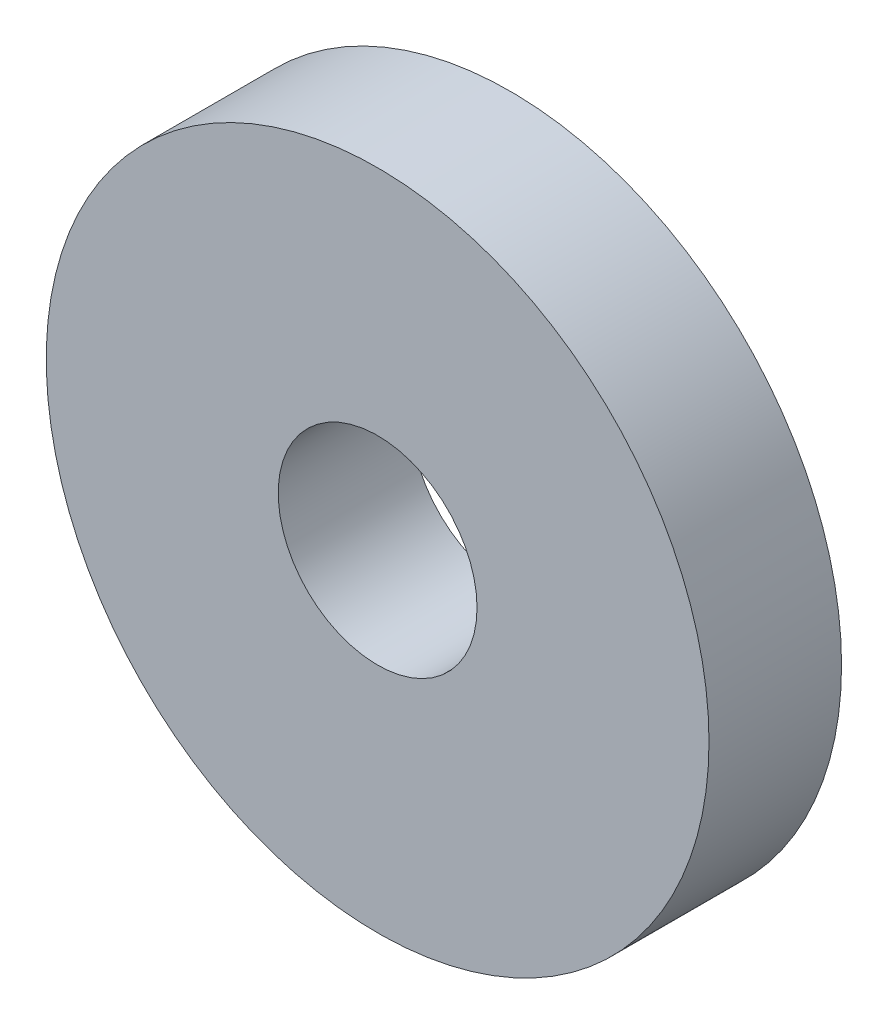
ISO-10303-21;
HEADER;
FILE_DESCRIPTION(('STEP AP214'),'2;1');
FILE_NAME('part.step','',(''),(''),'','','');
FILE_SCHEMA(('AUTOMOTIVE_DESIGN { 1 0 10303 214 1 1 1 1 }'));
ENDSEC;
DATA;
#1=APPLICATION_CONTEXT('core data for automotive mechanical design processes');
#2=APPLICATION_PROTOCOL_DEFINITION('international standard','automotive_design',2000,#1);
#3=PRODUCT_CONTEXT('',#1,'mechanical');
#4=PRODUCT('Part','Part','',(#3));
#5=PRODUCT_RELATED_PRODUCT_CATEGORY('part','',(#4));
#6=PRODUCT_DEFINITION_FORMATION('','',#4);
#7=PRODUCT_DEFINITION_CONTEXT('part definition',#1,'design');
#8=PRODUCT_DEFINITION('design','',#6,#7);
#9=PRODUCT_DEFINITION_SHAPE('','',#8);
#10=(LENGTH_UNIT() NAMED_UNIT(*) SI_UNIT(.MILLI.,.METRE.));
#11=(NAMED_UNIT(*) PLANE_ANGLE_UNIT() SI_UNIT($,.RADIAN.));
#12=(NAMED_UNIT(*) SI_UNIT($,.STERADIAN.) SOLID_ANGLE_UNIT());
#13=UNCERTAINTY_MEASURE_WITH_UNIT(LENGTH_MEASURE(1.E-05),#10,'distance_accuracy_value','');
#14=(GEOMETRIC_REPRESENTATION_CONTEXT(3) GLOBAL_UNCERTAINTY_ASSIGNED_CONTEXT((#13)) GLOBAL_UNIT_ASSIGNED_CONTEXT((#10,
#11,#12)) REPRESENTATION_CONTEXT('',''));
#15=CARTESIAN_POINT('',(0.,0.,0.));
#16=DIRECTION('',(0.,0.,1.));
#17=DIRECTION('',(1.,0.,0.));
#18=AXIS2_PLACEMENT_3D('',#15,#16,#17);
#19=CARTESIAN_POINT('',(0.,0.,4.));
#20=DIRECTION('',(0.,0.,1.));
#21=DIRECTION('',(1.,0.,0.));
#22=AXIS2_PLACEMENT_3D('',#19,#20,#21);
#23=PLANE('',#22);
#24=CARTESIAN_POINT('',(0.,0.,4.));
#25=DIRECTION('',(0.,0.,1.));
#26=DIRECTION('',(1.,0.,0.));
#27=AXIS2_PLACEMENT_3D('',#24,#25,#26);
#28=CIRCLE('',#27,10.);
#29=CARTESIAN_POINT('',(10.,0.,4.));
#30=VERTEX_POINT('',#29);
#31=EDGE_CURVE('E10',#30,#30,#28,.T.);
#32=ORIENTED_EDGE('',*,*,#31,.T.);
#33=EDGE_LOOP('',(#32));
#34=FACE_BOUND('',#33,.T.);
#35=CARTESIAN_POINT('',(0.,0.,4.));
#36=DIRECTION('',(0.,0.,1.));
#37=DIRECTION('',(1.,0.,0.));
#38=AXIS2_PLACEMENT_3D('',#35,#36,#37);
#39=CIRCLE('',#38,3.);
#40=CARTESIAN_POINT('',(3.,0.,4.));
#41=VERTEX_POINT('',#40);
#42=EDGE_CURVE('E45',#41,#41,#39,.T.);
#43=ORIENTED_EDGE('',*,*,#42,.F.);
#44=EDGE_LOOP('',(#43));
#45=FACE_BOUND('',#44,.T.);
#46=ADVANCED_FACE('F34',(#34,#45),#23,.T.);
#47=CARTESIAN_POINT('',(0.,0.,0.));
#48=DIRECTION('',(0.,0.,1.));
#49=DIRECTION('',(1.,0.,0.));
#50=AXIS2_PLACEMENT_3D('',#47,#48,#49);
#51=PLANE('',#50);
#52=CARTESIAN_POINT('',(0.,0.,0.));
#53=DIRECTION('',(0.,0.,1.));
#54=DIRECTION('',(1.,0.,0.));
#55=AXIS2_PLACEMENT_3D('',#52,#53,#54);
#56=CIRCLE('',#55,10.);
#57=CARTESIAN_POINT('',(10.,0.,0.));
#58=VERTEX_POINT('',#57);
#59=EDGE_CURVE('E38',#58,#58,#56,.T.);
#60=ORIENTED_EDGE('',*,*,#59,.F.);
#61=EDGE_LOOP('',(#60));
#62=FACE_BOUND('',#61,.T.);
#63=CARTESIAN_POINT('',(0.,0.,0.));
#64=DIRECTION('',(0.,0.,1.));
#65=DIRECTION('',(1.,0.,0.));
#66=AXIS2_PLACEMENT_3D('',#63,#64,#65);
#67=CIRCLE('',#66,3.);
#68=CARTESIAN_POINT('',(3.,0.,0.));
#69=VERTEX_POINT('',#68);
#70=EDGE_CURVE('E47',#69,#69,#67,.T.);
#71=ORIENTED_EDGE('',*,*,#70,.T.);
#72=EDGE_LOOP('',(#71));
#73=FACE_BOUND('',#72,.T.);
#74=ADVANCED_FACE('F57',(#62,#73),#51,.F.);
#75=CARTESIAN_POINT('',(0.,0.,4.));
#76=DIRECTION('',(0.,0.,-1.));
#77=DIRECTION('',(-1.,0.,0.));
#78=AXIS2_PLACEMENT_3D('',#75,#76,#77);
#79=CYLINDRICAL_SURFACE('',#78,10.);
#80=ORIENTED_EDGE('',*,*,#31,.F.);
#81=EDGE_LOOP('',(#80));
#82=FACE_BOUND('',#81,.T.);
#83=ORIENTED_EDGE('',*,*,#59,.T.);
#84=EDGE_LOOP('',(#83));
#85=FACE_BOUND('',#84,.T.);
#86=ADVANCED_FACE('F36',(#82,#85),#79,.T.);
#87=CARTESIAN_POINT('',(0.,0.,4.));
#88=DIRECTION('',(0.,0.,-1.));
#89=DIRECTION('',(-1.,0.,0.));
#90=AXIS2_PLACEMENT_3D('',#87,#88,#89);
#91=CYLINDRICAL_SURFACE('',#90,3.);
#92=ORIENTED_EDGE('',*,*,#42,.T.);
#93=EDGE_LOOP('',(#92));
#94=FACE_BOUND('',#93,.T.);
#95=ORIENTED_EDGE('',*,*,#70,.F.);
#96=EDGE_LOOP('',(#95));
#97=FACE_BOUND('',#96,.T.);
#98=ADVANCED_FACE('F53',(#94,#97),#91,.F.);
#99=CLOSED_SHELL('',(#46,#74,#86,#98));
#100=MANIFOLD_SOLID_BREP('B2',#99);
#101=ADVANCED_BREP_SHAPE_REPRESENTATION('',(#18,#100),#14);
#102=SHAPE_DEFINITION_REPRESENTATION(#9,#101);
ENDSEC;
END-ISO-10303-21;
